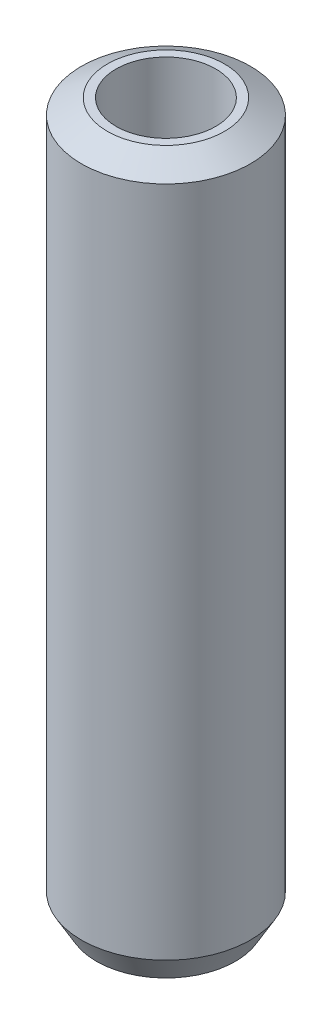
ISO-10303-21;
HEADER;
FILE_DESCRIPTION(('STEP AP214'),'2;1');
FILE_NAME('part.step','',(''),(''),'','','');
FILE_SCHEMA(('AUTOMOTIVE_DESIGN { 1 0 10303 214 1 1 1 1 }'));
ENDSEC;
DATA;
#1=APPLICATION_CONTEXT('core data for automotive mechanical design processes');
#2=APPLICATION_PROTOCOL_DEFINITION('international standard','automotive_design',2000,#1);
#3=PRODUCT_CONTEXT('',#1,'mechanical');
#4=PRODUCT('Part','Part','',(#3));
#5=PRODUCT_RELATED_PRODUCT_CATEGORY('part','',(#4));
#6=PRODUCT_DEFINITION_FORMATION('','',#4);
#7=PRODUCT_DEFINITION_CONTEXT('part definition',#1,'design');
#8=PRODUCT_DEFINITION('design','',#6,#7);
#9=PRODUCT_DEFINITION_SHAPE('','',#8);
#10=(LENGTH_UNIT() NAMED_UNIT(*) SI_UNIT(.MILLI.,.METRE.));
#11=(NAMED_UNIT(*) PLANE_ANGLE_UNIT() SI_UNIT($,.RADIAN.));
#12=(NAMED_UNIT(*) SI_UNIT($,.STERADIAN.) SOLID_ANGLE_UNIT());
#13=UNCERTAINTY_MEASURE_WITH_UNIT(LENGTH_MEASURE(1.E-05),#10,'distance_accuracy_value','');
#14=(GEOMETRIC_REPRESENTATION_CONTEXT(3) GLOBAL_UNCERTAINTY_ASSIGNED_CONTEXT((#13)) GLOBAL_UNIT_ASSIGNED_CONTEXT((#10,
#11,#12)) REPRESENTATION_CONTEXT('',''));
#15=CARTESIAN_POINT('',(0.,0.,0.));
#16=DIRECTION('',(0.,0.,1.));
#17=DIRECTION('',(1.,0.,0.));
#18=AXIS2_PLACEMENT_3D('',#15,#16,#17);
#19=CARTESIAN_POINT('',(0.,168.766630002241,0.));
#20=DIRECTION('',(0.,-1.,0.));
#21=DIRECTION('',(0.,0.,-1.));
#22=AXIS2_PLACEMENT_3D('',#19,#20,#21);
#23=CYLINDRICAL_SURFACE('',#22,20.);
#24=CARTESIAN_POINT('',(0.,165.21274974238,0.));
#25=DIRECTION('',(0.,1.,0.));
#26=DIRECTION('',(0.,0.,1.));
#27=AXIS2_PLACEMENT_3D('',#24,#25,#26);
#28=CIRCLE('',#27,20.);
#29=CARTESIAN_POINT('',(0.,165.21274974238,20.));
#30=VERTEX_POINT('',#29);
#31=EDGE_CURVE('E50',#30,#30,#28,.F.);
#32=ORIENTED_EDGE('',*,*,#31,.T.);
#33=EDGE_LOOP('',(#32));
#34=FACE_BOUND('',#33,.T.);
#35=CARTESIAN_POINT('',(0.,6.15550117409583,0.));
#36=DIRECTION('',(0.,1.,0.));
#37=DIRECTION('',(0.,0.,1.));
#38=AXIS2_PLACEMENT_3D('',#35,#36,#37);
#39=CIRCLE('',#38,20.);
#40=CARTESIAN_POINT('',(0.,6.15550117409583,20.));
#41=VERTEX_POINT('',#40);
#42=EDGE_CURVE('E51',#41,#41,#39,.T.);
#43=ORIENTED_EDGE('',*,*,#42,.T.);
#44=EDGE_LOOP('',(#43));
#45=FACE_BOUND('',#44,.T.);
#46=ADVANCED_FACE('F39',(#34,#45),#23,.T.);
#47=CARTESIAN_POINT('',(0.,168.766630002241,0.));
#48=DIRECTION('',(0.,1.,0.));
#49=DIRECTION('',(0.,0.,1.));
#50=AXIS2_PLACEMENT_3D('',#47,#48,#49);
#51=PLANE('',#50);
#52=CARTESIAN_POINT('',(0.,168.766630002241,0.));
#53=DIRECTION('',(0.,1.,0.));
#54=DIRECTION('',(0.,0.,1.));
#55=AXIS2_PLACEMENT_3D('',#52,#53,#54);
#56=CIRCLE('',#55,13.8444988259041);
#57=CARTESIAN_POINT('',(0.,168.766630002241,13.8444988259041));
#58=VERTEX_POINT('',#57);
#59=EDGE_CURVE('E54',#58,#58,#56,.T.);
#60=ORIENTED_EDGE('',*,*,#59,.T.);
#61=EDGE_LOOP('',(#60));
#62=FACE_BOUND('',#61,.T.);
#63=CARTESIAN_POINT('',(0.,168.766630002241,0.));
#64=DIRECTION('',(0.,1.,0.));
#65=DIRECTION('',(0.,0.,1.));
#66=AXIS2_PLACEMENT_3D('',#63,#64,#65);
#67=CIRCLE('',#66,11.7912578990899);
#68=CARTESIAN_POINT('',(0.,168.766630002241,11.7912578990899));
#69=VERTEX_POINT('',#68);
#70=EDGE_CURVE('E58',#69,#69,#67,.T.);
#71=ORIENTED_EDGE('',*,*,#70,.F.);
#72=EDGE_LOOP('',(#71));
#73=FACE_BOUND('',#72,.T.);
#74=ADVANCED_FACE('F69',(#62,#73),#51,.T.);
#75=CARTESIAN_POINT('',(0.,0.,0.));
#76=DIRECTION('',(0.,1.,0.));
#77=DIRECTION('',(0.,0.,1.));
#78=AXIS2_PLACEMENT_3D('',#75,#76,#77);
#79=PLANE('',#78);
#80=CARTESIAN_POINT('',(0.,0.,0.));
#81=DIRECTION('',(0.,1.,0.));
#82=DIRECTION('',(0.,0.,1.));
#83=AXIS2_PLACEMENT_3D('',#80,#81,#82);
#84=CIRCLE('',#83,16.4461197401387);
#85=CARTESIAN_POINT('',(0.,0.,16.4461197401387));
#86=VERTEX_POINT('',#85);
#87=EDGE_CURVE('E10',#86,#86,#84,.F.);
#88=ORIENTED_EDGE('',*,*,#87,.T.);
#89=EDGE_LOOP('',(#88));
#90=FACE_BOUND('',#89,.T.);
#91=CARTESIAN_POINT('',(0.,0.,0.));
#92=DIRECTION('',(0.,1.,0.));
#93=DIRECTION('',(0.,0.,1.));
#94=AXIS2_PLACEMENT_3D('',#91,#92,#93);
#95=CIRCLE('',#94,11.7912578990899);
#96=CARTESIAN_POINT('',(0.,0.,11.7912578990899));
#97=VERTEX_POINT('',#96);
#98=EDGE_CURVE('E63',#97,#97,#95,.T.);
#99=ORIENTED_EDGE('',*,*,#98,.T.);
#100=EDGE_LOOP('',(#99));
#101=FACE_BOUND('',#100,.T.);
#102=ADVANCED_FACE('F75',(#90,#101),#79,.F.);
#103=CARTESIAN_POINT('',(0.,168.766630002241,0.));
#104=DIRECTION('',(0.,-1.,0.));
#105=DIRECTION('',(0.,0.,-1.));
#106=AXIS2_PLACEMENT_3D('',#103,#104,#105);
#107=CYLINDRICAL_SURFACE('',#106,11.7912578990899);
#108=ORIENTED_EDGE('',*,*,#70,.T.);
#109=EDGE_LOOP('',(#108));
#110=FACE_BOUND('',#109,.T.);
#111=ORIENTED_EDGE('',*,*,#98,.F.);
#112=EDGE_LOOP('',(#111));
#113=FACE_BOUND('',#112,.T.);
#114=ADVANCED_FACE('F70',(#110,#113),#107,.F.);
#115=CARTESIAN_POINT('',(0.,168.766630002241,0.));
#116=DIRECTION('',(0.,-1.,0.));
#117=DIRECTION('',(0.,0.,-1.));
#118=AXIS2_PLACEMENT_3D('',#115,#116,#117);
#119=CONICAL_SURFACE('',#118,13.8444988259041,1.04719755119659);
#120=ORIENTED_EDGE('',*,*,#31,.F.);
#121=EDGE_LOOP('',(#120));
#122=FACE_BOUND('',#121,.T.);
#123=ORIENTED_EDGE('',*,*,#59,.F.);
#124=EDGE_LOOP('',(#123));
#125=FACE_BOUND('',#124,.T.);
#126=ADVANCED_FACE('F81',(#122,#125),#119,.T.);
#127=CARTESIAN_POINT('',(0.,6.15550117409583,0.));
#128=DIRECTION('',(0.,1.,0.));
#129=DIRECTION('',(0.,0.,1.));
#130=AXIS2_PLACEMENT_3D('',#127,#128,#129);
#131=CONICAL_SURFACE('',#130,20.,0.523598775598301);
#132=ORIENTED_EDGE('',*,*,#87,.F.);
#133=EDGE_LOOP('',(#132));
#134=FACE_BOUND('',#133,.T.);
#135=ORIENTED_EDGE('',*,*,#42,.F.);
#136=EDGE_LOOP('',(#135));
#137=FACE_BOUND('',#136,.T.);
#138=ADVANCED_FACE('F45',(#134,#137),#131,.T.);
#139=CLOSED_SHELL('',(#46,#74,#102,#114,#126,#138));
#140=MANIFOLD_SOLID_BREP('B2',#139);
#141=ADVANCED_BREP_SHAPE_REPRESENTATION('',(#18,#140),#14);
#142=SHAPE_DEFINITION_REPRESENTATION(#9,#141);
ENDSEC;
END-ISO-10303-21;
